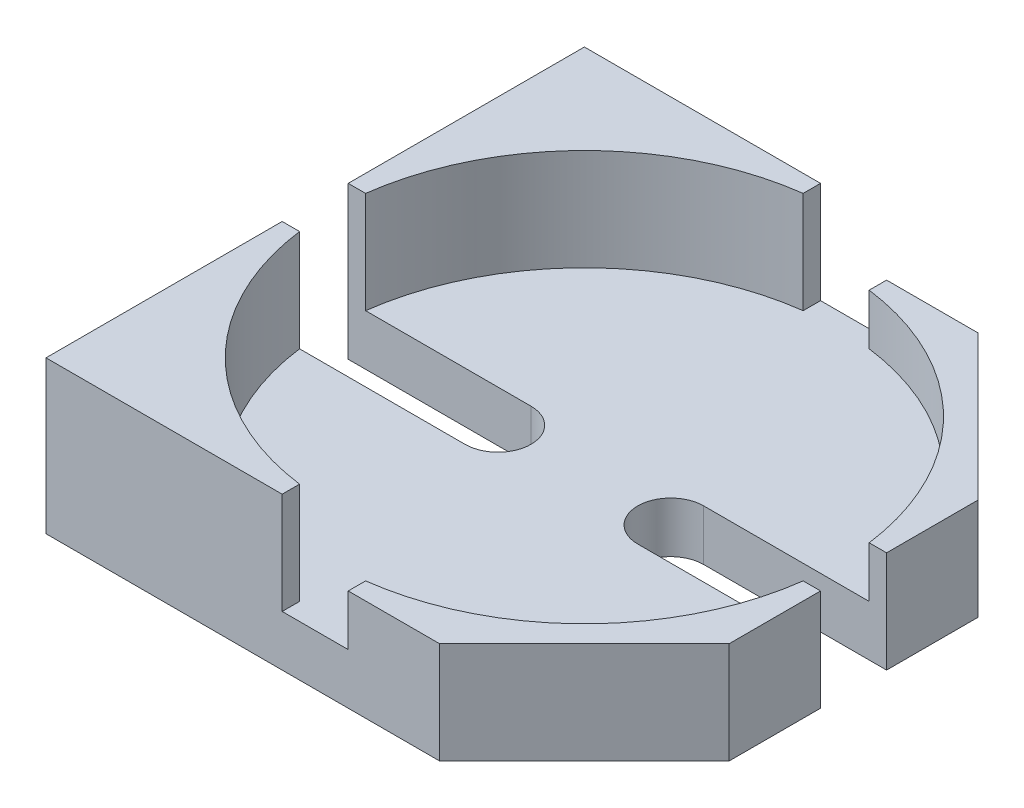
ISO-10303-21;
HEADER;
FILE_DESCRIPTION(('STEP AP214'),'2;1');
FILE_NAME('part.step','',(''),(''),'','','');
FILE_SCHEMA(('AUTOMOTIVE_DESIGN { 1 0 10303 214 1 1 1 1 }'));
ENDSEC;
DATA;
#1=APPLICATION_CONTEXT('core data for automotive mechanical design processes');
#2=APPLICATION_PROTOCOL_DEFINITION('international standard','automotive_design',2000,#1);
#3=PRODUCT_CONTEXT('',#1,'mechanical');
#4=PRODUCT('Part','Part','',(#3));
#5=PRODUCT_RELATED_PRODUCT_CATEGORY('part','',(#4));
#6=PRODUCT_DEFINITION_FORMATION('','',#4);
#7=PRODUCT_DEFINITION_CONTEXT('part definition',#1,'design');
#8=PRODUCT_DEFINITION('design','',#6,#7);
#9=PRODUCT_DEFINITION_SHAPE('','',#8);
#10=(LENGTH_UNIT() NAMED_UNIT(*) SI_UNIT(.MILLI.,.METRE.));
#11=(NAMED_UNIT(*) PLANE_ANGLE_UNIT() SI_UNIT($,.RADIAN.));
#12=(NAMED_UNIT(*) SI_UNIT($,.STERADIAN.) SOLID_ANGLE_UNIT());
#13=UNCERTAINTY_MEASURE_WITH_UNIT(LENGTH_MEASURE(1.E-05),#10,'distance_accuracy_value','');
#14=(GEOMETRIC_REPRESENTATION_CONTEXT(3) GLOBAL_UNCERTAINTY_ASSIGNED_CONTEXT((#13)) GLOBAL_UNIT_ASSIGNED_CONTEXT((#10,
#11,#12)) REPRESENTATION_CONTEXT('',''));
#15=CARTESIAN_POINT('',(0.,0.,0.));
#16=DIRECTION('',(0.,0.,1.));
#17=DIRECTION('',(1.,0.,0.));
#18=AXIS2_PLACEMENT_3D('',#15,#16,#17);
#19=CARTESIAN_POINT('',(0.,1.,0.));
#20=DIRECTION('',(0.,1.,0.));
#21=DIRECTION('',(1.,0.,0.));
#22=AXIS2_PLACEMENT_3D('',#19,#20,#21);
#23=PLANE('',#22);
#24=CARTESIAN_POINT('',(0.,1.,0.));
#25=DIRECTION('',(0.,1.,0.));
#26=DIRECTION('',(0.,0.,1.));
#27=AXIS2_PLACEMENT_3D('',#24,#25,#26);
#28=CIRCLE('',#27,2.5);
#29=CARTESIAN_POINT('',(0.325000000000007,1.,2.47878498462453));
#30=VERTEX_POINT('',#29);
#31=CARTESIAN_POINT('',(2.47878498462453,1.,0.325));
#32=VERTEX_POINT('',#31);
#33=EDGE_CURVE('E21',#30,#32,#28,.T.);
#34=ORIENTED_EDGE('',*,*,#33,.F.);
#35=DIRECTION('',(0.,0.,-1.));
#36=VECTOR('',#35,1.);
#37=CARTESIAN_POINT('',(0.325000000000007,1.,0.));
#38=LINE('',#37,#36);
#39=CARTESIAN_POINT('',(0.325000000000007,1.,2.65));
#40=VERTEX_POINT('',#39);
#41=EDGE_CURVE('E11',#40,#30,#38,.T.);
#42=ORIENTED_EDGE('',*,*,#41,.F.);
#43=DIRECTION('',(1.,0.,0.));
#44=VECTOR('',#43,1.);
#45=CARTESIAN_POINT('',(0.,1.,2.65));
#46=LINE('',#45,#44);
#47=CARTESIAN_POINT('',(1.22500000000002,1.,2.65));
#48=VERTEX_POINT('',#47);
#49=EDGE_CURVE('E328',#40,#48,#46,.T.);
#50=ORIENTED_EDGE('',*,*,#49,.T.);
#51=DIRECTION('',(0.707106781186544,0.,-0.707106781186552));
#52=VECTOR('',#51,1.);
#53=CARTESIAN_POINT('',(1.9375,1.,1.9375));
#54=LINE('',#53,#52);
#55=CARTESIAN_POINT('',(2.65,1.,1.225));
#56=VERTEX_POINT('',#55);
#57=EDGE_CURVE('E312',#48,#56,#54,.T.);
#58=ORIENTED_EDGE('',*,*,#57,.T.);
#59=DIRECTION('',(0.,0.,-1.));
#60=VECTOR('',#59,1.);
#61=CARTESIAN_POINT('',(2.65,1.,0.));
#62=LINE('',#61,#60);
#63=CARTESIAN_POINT('',(2.65,1.,0.325));
#64=VERTEX_POINT('',#63);
#65=EDGE_CURVE('E300',#56,#64,#62,.T.);
#66=ORIENTED_EDGE('',*,*,#65,.T.);
#67=DIRECTION('',(-1.,0.,0.));
#68=VECTOR('',#67,1.);
#69=CARTESIAN_POINT('',(0.,1.,0.325));
#70=LINE('',#69,#68);
#71=EDGE_CURVE('E284',#64,#32,#70,.T.);
#72=ORIENTED_EDGE('',*,*,#71,.T.);
#73=EDGE_LOOP('',(#34,#42,#50,#58,#66,#72));
#74=FACE_BOUND('',#73,.T.);
#75=ADVANCED_FACE('F17',(#74),#23,.T.);
#76=CARTESIAN_POINT('',(0.325000000000007,1.,0.));
#77=DIRECTION('',(-1.,0.,0.));
#78=DIRECTION('',(0.,0.,1.));
#79=AXIS2_PLACEMENT_3D('',#76,#77,#78);
#80=PLANE('',#79);
#81=DIRECTION('',(0.,0.,-1.));
#82=VECTOR('',#81,1.);
#83=CARTESIAN_POINT('',(0.325000000000007,0.5,0.));
#84=LINE('',#83,#82);
#85=CARTESIAN_POINT('',(0.325000000000007,0.5,2.65));
#86=VERTEX_POINT('',#85);
#87=CARTESIAN_POINT('',(0.325000000000007,0.5,2.47878498462453));
#88=VERTEX_POINT('',#87);
#89=EDGE_CURVE('E360',#86,#88,#84,.T.);
#90=ORIENTED_EDGE('',*,*,#89,.F.);
#91=DIRECTION('',(0.,-1.,0.));
#92=VECTOR('',#91,1.);
#93=CARTESIAN_POINT('',(0.325000000000007,1.,2.65));
#94=LINE('',#93,#92);
#95=EDGE_CURVE('E324',#40,#86,#94,.T.);
#96=ORIENTED_EDGE('',*,*,#95,.F.);
#97=ORIENTED_EDGE('',*,*,#41,.T.);
#98=DIRECTION('',(0.,-1.,0.));
#99=VECTOR('',#98,1.);
#100=CARTESIAN_POINT('',(0.325000000000007,1.,2.47878498462453));
#101=LINE('',#100,#99);
#102=EDGE_CURVE('E130',#30,#88,#101,.T.);
#103=ORIENTED_EDGE('',*,*,#102,.T.);
#104=EDGE_LOOP('',(#90,#96,#97,#103));
#105=FACE_BOUND('',#104,.T.);
#106=ADVANCED_FACE('F19',(#105),#80,.T.);
#107=CARTESIAN_POINT('',(0.,1.,0.));
#108=DIRECTION('',(0.,-1.,0.));
#109=DIRECTION('',(0.,0.,-1.));
#110=AXIS2_PLACEMENT_3D('',#107,#108,#109);
#111=CYLINDRICAL_SURFACE('',#110,2.5);
#112=CARTESIAN_POINT('',(0.,0.5,0.));
#113=DIRECTION('',(0.,1.,0.));
#114=DIRECTION('',(0.,0.,1.));
#115=AXIS2_PLACEMENT_3D('',#112,#113,#114);
#116=CIRCLE('',#115,2.5);
#117=CARTESIAN_POINT('',(2.47878498462453,0.5,0.325));
#118=VERTEX_POINT('',#117);
#119=EDGE_CURVE('E423',#88,#118,#116,.T.);
#120=ORIENTED_EDGE('',*,*,#119,.F.);
#121=ORIENTED_EDGE('',*,*,#102,.F.);
#122=ORIENTED_EDGE('',*,*,#33,.T.);
#123=DIRECTION('',(0.,-1.,0.));
#124=VECTOR('',#123,1.);
#125=CARTESIAN_POINT('',(2.47878498462453,1.,0.325));
#126=LINE('',#125,#124);
#127=EDGE_CURVE('E288',#32,#118,#126,.T.);
#128=ORIENTED_EDGE('',*,*,#127,.T.);
#129=EDGE_LOOP('',(#120,#121,#122,#128));
#130=FACE_BOUND('',#129,.T.);
#131=ADVANCED_FACE('F833',(#130),#111,.F.);
#132=CARTESIAN_POINT('',(0.,1.,0.));
#133=DIRECTION('',(0.,1.,0.));
#134=DIRECTION('',(1.,0.,0.));
#135=AXIS2_PLACEMENT_3D('',#132,#133,#134);
#136=PLANE('',#135);
#137=CARTESIAN_POINT('',(0.,1.,0.));
#138=DIRECTION('',(0.,1.,0.));
#139=DIRECTION('',(0.,0.,1.));
#140=AXIS2_PLACEMENT_3D('',#137,#138,#139);
#141=CIRCLE('',#140,2.5);
#142=CARTESIAN_POINT('',(2.47878498462453,1.,-0.325));
#143=VERTEX_POINT('',#142);
#144=CARTESIAN_POINT('',(0.325000000000015,1.,-2.47878498462452));
#145=VERTEX_POINT('',#144);
#146=EDGE_CURVE('E95',#143,#145,#141,.T.);
#147=ORIENTED_EDGE('',*,*,#146,.F.);
#148=DIRECTION('',(1.,0.,0.));
#149=VECTOR('',#148,1.);
#150=CARTESIAN_POINT('',(0.,1.,-0.325));
#151=LINE('',#150,#149);
#152=CARTESIAN_POINT('',(2.65,1.,-0.325));
#153=VERTEX_POINT('',#152);
#154=EDGE_CURVE('E270',#143,#153,#151,.T.);
#155=ORIENTED_EDGE('',*,*,#154,.T.);
#156=DIRECTION('',(0.,0.,-1.));
#157=VECTOR('',#156,1.);
#158=CARTESIAN_POINT('',(2.65,1.,0.));
#159=LINE('',#158,#157);
#160=CARTESIAN_POINT('',(2.65,1.,-1.225));
#161=VERTEX_POINT('',#160);
#162=EDGE_CURVE('E257',#153,#161,#159,.T.);
#163=ORIENTED_EDGE('',*,*,#162,.T.);
#164=DIRECTION('',(-0.707106781186549,0.,-0.707106781186546));
#165=VECTOR('',#164,1.);
#166=CARTESIAN_POINT('',(1.9375,1.,-1.9375));
#167=LINE('',#166,#165);
#168=CARTESIAN_POINT('',(1.225,1.,-2.65));
#169=VERTEX_POINT('',#168);
#170=EDGE_CURVE('E245',#161,#169,#167,.T.);
#171=ORIENTED_EDGE('',*,*,#170,.T.);
#172=DIRECTION('',(-1.,0.,0.));
#173=VECTOR('',#172,1.);
#174=CARTESIAN_POINT('',(0.,1.,-2.65));
#175=LINE('',#174,#173);
#176=CARTESIAN_POINT('',(0.325000000000015,1.,-2.65));
#177=VERTEX_POINT('',#176);
#178=EDGE_CURVE('E218',#169,#177,#175,.T.);
#179=ORIENTED_EDGE('',*,*,#178,.T.);
#180=DIRECTION('',(0.,0.,1.));
#181=VECTOR('',#180,1.);
#182=CARTESIAN_POINT('',(0.325000000000015,1.,0.));
#183=LINE('',#182,#181);
#184=EDGE_CURVE('E128',#177,#145,#183,.T.);
#185=ORIENTED_EDGE('',*,*,#184,.T.);
#186=EDGE_LOOP('',(#147,#155,#163,#171,#179,#185));
#187=FACE_BOUND('',#186,.T.);
#188=ADVANCED_FACE('F840',(#187),#136,.T.);
#189=CARTESIAN_POINT('',(0.325000000000015,1.,0.));
#190=DIRECTION('',(1.,0.,0.));
#191=DIRECTION('',(0.,1.,0.));
#192=AXIS2_PLACEMENT_3D('',#189,#190,#191);
#193=PLANE('',#192);
#194=DIRECTION('',(0.,0.,1.));
#195=VECTOR('',#194,1.);
#196=CARTESIAN_POINT('',(0.325000000000015,0.5,0.));
#197=LINE('',#196,#195);
#198=CARTESIAN_POINT('',(0.325000000000015,0.5,-2.65));
#199=VERTEX_POINT('',#198);
#200=CARTESIAN_POINT('',(0.325000000000015,0.5,-2.47878498462452));
#201=VERTEX_POINT('',#200);
#202=EDGE_CURVE('E394',#199,#201,#197,.T.);
#203=ORIENTED_EDGE('',*,*,#202,.T.);
#204=DIRECTION('',(0.,-1.,0.));
#205=VECTOR('',#204,1.);
#206=CARTESIAN_POINT('',(0.325000000000015,1.,-2.47878498462452));
#207=LINE('',#206,#205);
#208=EDGE_CURVE('E125',#145,#201,#207,.T.);
#209=ORIENTED_EDGE('',*,*,#208,.F.);
#210=ORIENTED_EDGE('',*,*,#184,.F.);
#211=DIRECTION('',(0.,-1.,0.));
#212=VECTOR('',#211,1.);
#213=CARTESIAN_POINT('',(0.325000000000015,1.,-2.65));
#214=LINE('',#213,#212);
#215=EDGE_CURVE('E223',#177,#199,#214,.T.);
#216=ORIENTED_EDGE('',*,*,#215,.T.);
#217=EDGE_LOOP('',(#203,#209,#210,#216));
#218=FACE_BOUND('',#217,.T.);
#219=ADVANCED_FACE('F848',(#218),#193,.F.);
#220=CARTESIAN_POINT('',(0.,1.,0.));
#221=DIRECTION('',(0.,-1.,0.));
#222=DIRECTION('',(0.,0.,-1.));
#223=AXIS2_PLACEMENT_3D('',#220,#221,#222);
#224=CYLINDRICAL_SURFACE('',#223,2.5);
#225=CARTESIAN_POINT('',(0.,0.5,0.));
#226=DIRECTION('',(0.,1.,0.));
#227=DIRECTION('',(0.,0.,1.));
#228=AXIS2_PLACEMENT_3D('',#225,#226,#227);
#229=CIRCLE('',#228,2.5);
#230=CARTESIAN_POINT('',(2.47878498462453,0.5,-0.325));
#231=VERTEX_POINT('',#230);
#232=EDGE_CURVE('E398',#231,#201,#229,.T.);
#233=ORIENTED_EDGE('',*,*,#232,.F.);
#234=DIRECTION('',(0.,-1.,0.));
#235=VECTOR('',#234,1.);
#236=CARTESIAN_POINT('',(2.47878498462453,1.,-0.325));
#237=LINE('',#236,#235);
#238=EDGE_CURVE('E266',#143,#231,#237,.T.);
#239=ORIENTED_EDGE('',*,*,#238,.F.);
#240=ORIENTED_EDGE('',*,*,#146,.T.);
#241=ORIENTED_EDGE('',*,*,#208,.T.);
#242=EDGE_LOOP('',(#233,#239,#240,#241));
#243=FACE_BOUND('',#242,.T.);
#244=ADVANCED_FACE('F856',(#243),#224,.F.);
#245=CARTESIAN_POINT('',(0.,1.5,0.));
#246=DIRECTION('',(0.,1.,0.));
#247=DIRECTION('',(1.,0.,0.));
#248=AXIS2_PLACEMENT_3D('',#245,#246,#247);
#249=PLANE('',#248);
#250=CARTESIAN_POINT('',(0.,1.5,0.));
#251=DIRECTION('',(0.,1.,0.));
#252=DIRECTION('',(0.,0.,1.));
#253=AXIS2_PLACEMENT_3D('',#250,#251,#252);
#254=CIRCLE('',#253,2.5);
#255=CARTESIAN_POINT('',(-2.47878498462453,1.5,0.325));
#256=VERTEX_POINT('',#255);
#257=CARTESIAN_POINT('',(-0.325000000000006,1.5,2.47878498462453));
#258=VERTEX_POINT('',#257);
#259=EDGE_CURVE('E85',#256,#258,#254,.T.);
#260=ORIENTED_EDGE('',*,*,#259,.F.);
#261=DIRECTION('',(-1.,0.,0.));
#262=VECTOR('',#261,1.);
#263=CARTESIAN_POINT('',(0.,1.5,0.325));
#264=LINE('',#263,#262);
#265=CARTESIAN_POINT('',(-2.65,1.5,0.325));
#266=VERTEX_POINT('',#265);
#267=EDGE_CURVE('E152',#256,#266,#264,.T.);
#268=ORIENTED_EDGE('',*,*,#267,.T.);
#269=DIRECTION('',(0.,0.,1.));
#270=VECTOR('',#269,1.);
#271=CARTESIAN_POINT('',(-2.65,1.5,0.));
#272=LINE('',#271,#270);
#273=CARTESIAN_POINT('',(-2.65,1.5,2.65));
#274=VERTEX_POINT('',#273);
#275=EDGE_CURVE('E341',#266,#274,#272,.T.);
#276=ORIENTED_EDGE('',*,*,#275,.T.);
#277=DIRECTION('',(1.,0.,0.));
#278=VECTOR('',#277,1.);
#279=CARTESIAN_POINT('',(0.,1.5,2.65));
#280=LINE('',#279,#278);
#281=CARTESIAN_POINT('',(-0.325000000000006,1.5,2.65));
#282=VERTEX_POINT('',#281);
#283=EDGE_CURVE('E90',#274,#282,#280,.T.);
#284=ORIENTED_EDGE('',*,*,#283,.T.);
#285=DIRECTION('',(0.,0.,-1.));
#286=VECTOR('',#285,1.);
#287=CARTESIAN_POINT('',(-0.325000000000007,1.5,0.));
#288=LINE('',#287,#286);
#289=EDGE_CURVE('E80',#282,#258,#288,.T.);
#290=ORIENTED_EDGE('',*,*,#289,.T.);
#291=EDGE_LOOP('',(#260,#268,#276,#284,#290));
#292=FACE_BOUND('',#291,.T.);
#293=ADVANCED_FACE('F82',(#292),#249,.T.);
#294=CARTESIAN_POINT('',(-0.325000000000007,1.5,0.));
#295=DIRECTION('',(-1.,0.,0.));
#296=DIRECTION('',(0.,1.,0.));
#297=AXIS2_PLACEMENT_3D('',#294,#295,#296);
#298=PLANE('',#297);
#299=DIRECTION('',(0.,0.,-1.));
#300=VECTOR('',#299,1.);
#301=CARTESIAN_POINT('',(-0.325000000000007,0.5,0.));
#302=LINE('',#301,#300);
#303=CARTESIAN_POINT('',(-0.325000000000006,0.5,2.65));
#304=VERTEX_POINT('',#303);
#305=CARTESIAN_POINT('',(-0.325000000000006,0.5,2.47878498462453));
#306=VERTEX_POINT('',#305);
#307=EDGE_CURVE('E103',#304,#306,#302,.T.);
#308=ORIENTED_EDGE('',*,*,#307,.T.);
#309=DIRECTION('',(0.,-1.,0.));
#310=VECTOR('',#309,1.);
#311=CARTESIAN_POINT('',(-0.325000000000006,1.5,2.47878498462453));
#312=LINE('',#311,#310);
#313=EDGE_CURVE('E96',#258,#306,#312,.T.);
#314=ORIENTED_EDGE('',*,*,#313,.F.);
#315=ORIENTED_EDGE('',*,*,#289,.F.);
#316=DIRECTION('',(0.,-1.,0.));
#317=VECTOR('',#316,1.);
#318=CARTESIAN_POINT('',(-0.325000000000006,1.5,2.65));
#319=LINE('',#318,#317);
#320=EDGE_CURVE('E321',#282,#304,#319,.T.);
#321=ORIENTED_EDGE('',*,*,#320,.T.);
#322=EDGE_LOOP('',(#308,#314,#315,#321));
#323=FACE_BOUND('',#322,.T.);
#324=ADVANCED_FACE('F100',(#323),#298,.F.);
#325=CARTESIAN_POINT('',(0.,1.5,0.));
#326=DIRECTION('',(0.,-1.,0.));
#327=DIRECTION('',(0.,0.,-1.));
#328=AXIS2_PLACEMENT_3D('',#325,#326,#327);
#329=CYLINDRICAL_SURFACE('',#328,2.5);
#330=CARTESIAN_POINT('',(0.,0.5,0.));
#331=DIRECTION('',(0.,1.,0.));
#332=DIRECTION('',(0.,0.,1.));
#333=AXIS2_PLACEMENT_3D('',#330,#331,#332);
#334=CIRCLE('',#333,2.5);
#335=CARTESIAN_POINT('',(-2.47878498462453,0.5,0.325));
#336=VERTEX_POINT('',#335);
#337=EDGE_CURVE('E361',#336,#306,#334,.T.);
#338=ORIENTED_EDGE('',*,*,#337,.F.);
#339=DIRECTION('',(0.,-1.,0.));
#340=VECTOR('',#339,1.);
#341=CARTESIAN_POINT('',(-2.47878498462453,1.5,0.325));
#342=LINE('',#341,#340);
#343=EDGE_CURVE('E111',#256,#336,#342,.T.);
#344=ORIENTED_EDGE('',*,*,#343,.F.);
#345=ORIENTED_EDGE('',*,*,#259,.T.);
#346=ORIENTED_EDGE('',*,*,#313,.T.);
#347=EDGE_LOOP('',(#338,#344,#345,#346));
#348=FACE_BOUND('',#347,.T.);
#349=ADVANCED_FACE('F109',(#348),#329,.F.);
#350=CARTESIAN_POINT('',(0.,1.5,0.));
#351=DIRECTION('',(0.,1.,0.));
#352=DIRECTION('',(1.,0.,0.));
#353=AXIS2_PLACEMENT_3D('',#350,#351,#352);
#354=PLANE('',#353);
#355=CARTESIAN_POINT('',(0.,1.5,0.));
#356=DIRECTION('',(0.,1.,0.));
#357=DIRECTION('',(0.,0.,1.));
#358=AXIS2_PLACEMENT_3D('',#355,#356,#357);
#359=CIRCLE('',#358,2.5);
#360=CARTESIAN_POINT('',(-0.325000000000009,1.5,-2.47878498462453));
#361=VERTEX_POINT('',#360);
#362=CARTESIAN_POINT('',(-2.47878498462453,1.5,-0.325));
#363=VERTEX_POINT('',#362);
#364=EDGE_CURVE('E120',#361,#363,#359,.T.);
#365=ORIENTED_EDGE('',*,*,#364,.F.);
#366=DIRECTION('',(0.,0.,1.));
#367=VECTOR('',#366,1.);
#368=CARTESIAN_POINT('',(-0.325000000000008,1.5,0.));
#369=LINE('',#368,#367);
#370=CARTESIAN_POINT('',(-0.32500000000001,1.5,-2.65));
#371=VERTEX_POINT('',#370);
#372=EDGE_CURVE('E114',#371,#361,#369,.T.);
#373=ORIENTED_EDGE('',*,*,#372,.F.);
#374=DIRECTION('',(-1.,0.,0.));
#375=VECTOR('',#374,1.);
#376=CARTESIAN_POINT('',(0.,1.5,-2.65));
#377=LINE('',#376,#375);
#378=CARTESIAN_POINT('',(-2.65,1.5,-2.65));
#379=VERTEX_POINT('',#378);
#380=EDGE_CURVE('E228',#371,#379,#377,.T.);
#381=ORIENTED_EDGE('',*,*,#380,.T.);
#382=DIRECTION('',(0.,0.,1.));
#383=VECTOR('',#382,1.);
#384=CARTESIAN_POINT('',(-2.65,1.5,0.));
#385=LINE('',#384,#383);
#386=CARTESIAN_POINT('',(-2.65,1.5,-0.325));
#387=VERTEX_POINT('',#386);
#388=EDGE_CURVE('E185',#379,#387,#385,.T.);
#389=ORIENTED_EDGE('',*,*,#388,.T.);
#390=DIRECTION('',(1.,0.,0.));
#391=VECTOR('',#390,1.);
#392=CARTESIAN_POINT('',(0.,1.5,-0.325));
#393=LINE('',#392,#391);
#394=EDGE_CURVE('E182',#387,#363,#393,.T.);
#395=ORIENTED_EDGE('',*,*,#394,.T.);
#396=EDGE_LOOP('',(#365,#373,#381,#389,#395));
#397=FACE_BOUND('',#396,.T.);
#398=ADVANCED_FACE('F183',(#397),#354,.T.);
#399=CARTESIAN_POINT('',(-0.325000000000008,1.5,0.));
#400=DIRECTION('',(1.,0.,0.));
#401=DIRECTION('',(0.,0.,-1.));
#402=AXIS2_PLACEMENT_3D('',#399,#400,#401);
#403=PLANE('',#402);
#404=DIRECTION('',(0.,0.,1.));
#405=VECTOR('',#404,1.);
#406=CARTESIAN_POINT('',(-0.325000000000008,0.5,0.));
#407=LINE('',#406,#405);
#408=CARTESIAN_POINT('',(-0.32500000000001,0.5,-2.65));
#409=VERTEX_POINT('',#408);
#410=CARTESIAN_POINT('',(-0.325000000000009,0.5,-2.47878498462453));
#411=VERTEX_POINT('',#410);
#412=EDGE_CURVE('E381',#409,#411,#407,.T.);
#413=ORIENTED_EDGE('',*,*,#412,.F.);
#414=DIRECTION('',(0.,-1.,0.));
#415=VECTOR('',#414,1.);
#416=CARTESIAN_POINT('',(-0.32500000000001,1.5,-2.65));
#417=LINE('',#416,#415);
#418=EDGE_CURVE('E227',#371,#409,#417,.T.);
#419=ORIENTED_EDGE('',*,*,#418,.F.);
#420=ORIENTED_EDGE('',*,*,#372,.T.);
#421=DIRECTION('',(0.,-1.,0.));
#422=VECTOR('',#421,1.);
#423=CARTESIAN_POINT('',(-0.325000000000009,1.5,-2.47878498462453));
#424=LINE('',#423,#422);
#425=EDGE_CURVE('E157',#361,#411,#424,.T.);
#426=ORIENTED_EDGE('',*,*,#425,.T.);
#427=EDGE_LOOP('',(#413,#419,#420,#426));
#428=FACE_BOUND('',#427,.T.);
#429=ADVANCED_FACE('F894',(#428),#403,.T.);
#430=CARTESIAN_POINT('',(0.,1.5,0.));
#431=DIRECTION('',(0.,-1.,0.));
#432=DIRECTION('',(0.,0.,-1.));
#433=AXIS2_PLACEMENT_3D('',#430,#431,#432);
#434=CYLINDRICAL_SURFACE('',#433,2.5);
#435=CARTESIAN_POINT('',(0.,0.5,0.));
#436=DIRECTION('',(0.,1.,0.));
#437=DIRECTION('',(0.,0.,1.));
#438=AXIS2_PLACEMENT_3D('',#435,#436,#437);
#439=CIRCLE('',#438,2.5);
#440=CARTESIAN_POINT('',(-2.47878498462453,0.5,-0.325));
#441=VERTEX_POINT('',#440);
#442=EDGE_CURVE('E377',#411,#441,#439,.T.);
#443=ORIENTED_EDGE('',*,*,#442,.F.);
#444=ORIENTED_EDGE('',*,*,#425,.F.);
#445=ORIENTED_EDGE('',*,*,#364,.T.);
#446=DIRECTION('',(0.,-1.,0.));
#447=VECTOR('',#446,1.);
#448=CARTESIAN_POINT('',(-2.47878498462453,1.5,-0.325));
#449=LINE('',#448,#447);
#450=EDGE_CURVE('E177',#363,#441,#449,.T.);
#451=ORIENTED_EDGE('',*,*,#450,.T.);
#452=EDGE_LOOP('',(#443,#444,#445,#451));
#453=FACE_BOUND('',#452,.T.);
#454=ADVANCED_FACE('F174',(#453),#434,.F.);
#455=CARTESIAN_POINT('',(0.85,0.,0.));
#456=DIRECTION('',(0.,1.,0.));
#457=DIRECTION('',(1.,0.,0.));
#458=AXIS2_PLACEMENT_3D('',#455,#456,#457);
#459=PLANE('',#458);
#460=DIRECTION('',(0.,0.,1.));
#461=VECTOR('',#460,1.);
#462=CARTESIAN_POINT('',(-2.65,0.,0.325));
#463=LINE('',#462,#461);
#464=CARTESIAN_POINT('',(-2.65,0.,0.325));
#465=VERTEX_POINT('',#464);
#466=CARTESIAN_POINT('',(-2.65,0.,2.65));
#467=VERTEX_POINT('',#466);
#468=EDGE_CURVE('E356',#465,#467,#463,.T.);
#469=ORIENTED_EDGE('',*,*,#468,.F.);
#470=DIRECTION('',(-1.,0.,0.));
#471=VECTOR('',#470,1.);
#472=CARTESIAN_POINT('',(-0.85,0.,0.325));
#473=LINE('',#472,#471);
#474=CARTESIAN_POINT('',(-0.85,0.,0.325));
#475=VERTEX_POINT('',#474);
#476=EDGE_CURVE('E155',#475,#465,#473,.T.);
#477=ORIENTED_EDGE('',*,*,#476,.F.);
#478=CARTESIAN_POINT('',(-0.85,0.,0.));
#479=DIRECTION('',(0.,-1.,0.));
#480=DIRECTION('',(0.,0.,1.));
#481=AXIS2_PLACEMENT_3D('',#478,#479,#480);
#482=CIRCLE('',#481,0.325);
#483=CARTESIAN_POINT('',(-0.85,0.,-0.325));
#484=VERTEX_POINT('',#483);
#485=EDGE_CURVE('E150',#484,#475,#482,.T.);
#486=ORIENTED_EDGE('',*,*,#485,.F.);
#487=DIRECTION('',(1.,0.,0.));
#488=VECTOR('',#487,1.);
#489=CARTESIAN_POINT('',(-0.85,0.,-0.325));
#490=LINE('',#489,#488);
#491=CARTESIAN_POINT('',(-2.65,0.,-0.325));
#492=VERTEX_POINT('',#491);
#493=EDGE_CURVE('E203',#492,#484,#490,.T.);
#494=ORIENTED_EDGE('',*,*,#493,.F.);
#495=DIRECTION('',(0.,0.,1.));
#496=VECTOR('',#495,1.);
#497=CARTESIAN_POINT('',(-2.65,0.,-2.65));
#498=LINE('',#497,#496);
#499=CARTESIAN_POINT('',(-2.65,0.,-2.65));
#500=VERTEX_POINT('',#499);
#501=EDGE_CURVE('E211',#500,#492,#498,.T.);
#502=ORIENTED_EDGE('',*,*,#501,.F.);
#503=DIRECTION('',(-1.,0.,0.));
#504=VECTOR('',#503,1.);
#505=CARTESIAN_POINT('',(1.225,0.,-2.65));
#506=LINE('',#505,#504);
#507=CARTESIAN_POINT('',(1.225,0.,-2.65));
#508=VERTEX_POINT('',#507);
#509=EDGE_CURVE('E235',#508,#500,#506,.T.);
#510=ORIENTED_EDGE('',*,*,#509,.F.);
#511=DIRECTION('',(-0.707106781186549,0.,-0.707106781186546));
#512=VECTOR('',#511,1.);
#513=CARTESIAN_POINT('',(1.225,0.,-2.65));
#514=LINE('',#513,#512);
#515=CARTESIAN_POINT('',(2.65,0.,-1.225));
#516=VERTEX_POINT('',#515);
#517=EDGE_CURVE('E253',#516,#508,#514,.T.);
#518=ORIENTED_EDGE('',*,*,#517,.F.);
#519=DIRECTION('',(0.,0.,-1.));
#520=VECTOR('',#519,1.);
#521=CARTESIAN_POINT('',(2.65,0.,-1.225));
#522=LINE('',#521,#520);
#523=CARTESIAN_POINT('',(2.65,0.,-0.325));
#524=VERTEX_POINT('',#523);
#525=EDGE_CURVE('E262',#524,#516,#522,.T.);
#526=ORIENTED_EDGE('',*,*,#525,.F.);
#527=DIRECTION('',(1.,0.,0.));
#528=VECTOR('',#527,1.);
#529=CARTESIAN_POINT('',(0.85,0.,-0.325));
#530=LINE('',#529,#528);
#531=CARTESIAN_POINT('',(0.85,0.,-0.325));
#532=VERTEX_POINT('',#531);
#533=EDGE_CURVE('E279',#532,#524,#530,.T.);
#534=ORIENTED_EDGE('',*,*,#533,.F.);
#535=CARTESIAN_POINT('',(0.85,0.,0.));
#536=DIRECTION('',(0.,-1.,0.));
#537=DIRECTION('',(0.,0.,1.));
#538=AXIS2_PLACEMENT_3D('',#535,#536,#537);
#539=CIRCLE('',#538,0.325);
#540=CARTESIAN_POINT('',(0.85,0.,0.325));
#541=VERTEX_POINT('',#540);
#542=EDGE_CURVE('E280',#541,#532,#539,.T.);
#543=ORIENTED_EDGE('',*,*,#542,.F.);
#544=DIRECTION('',(-1.,0.,0.));
#545=VECTOR('',#544,1.);
#546=CARTESIAN_POINT('',(0.85,0.,0.325));
#547=LINE('',#546,#545);
#548=CARTESIAN_POINT('',(2.65,0.,0.325));
#549=VERTEX_POINT('',#548);
#550=EDGE_CURVE('E296',#549,#541,#547,.T.);
#551=ORIENTED_EDGE('',*,*,#550,.F.);
#552=DIRECTION('',(0.,0.,-1.));
#553=VECTOR('',#552,1.);
#554=CARTESIAN_POINT('',(2.65,0.,0.325));
#555=LINE('',#554,#553);
#556=CARTESIAN_POINT('',(2.65,0.,1.225));
#557=VERTEX_POINT('',#556);
#558=EDGE_CURVE('E308',#557,#549,#555,.T.);
#559=ORIENTED_EDGE('',*,*,#558,.F.);
#560=DIRECTION('',(0.707106781186544,0.,-0.707106781186552));
#561=VECTOR('',#560,1.);
#562=CARTESIAN_POINT('',(1.22500000000002,0.,2.65));
#563=LINE('',#562,#561);
#564=CARTESIAN_POINT('',(1.22500000000002,0.,2.65));
#565=VERTEX_POINT('',#564);
#566=EDGE_CURVE('E317',#565,#557,#563,.T.);
#567=ORIENTED_EDGE('',*,*,#566,.F.);
#568=DIRECTION('',(1.,0.,0.));
#569=VECTOR('',#568,1.);
#570=CARTESIAN_POINT('',(1.22500000000002,0.,2.65));
#571=LINE('',#570,#569);
#572=EDGE_CURVE('E336',#467,#565,#571,.T.);
#573=ORIENTED_EDGE('',*,*,#572,.F.);
#574=EDGE_LOOP('',(#469,#477,#486,#494,#502,#510,#518,#526,#534,#543,#551,#559,#567,#573));
#575=FACE_BOUND('',#574,.T.);
#576=ADVANCED_FACE('F447',(#575),#459,.F.);
#577=CARTESIAN_POINT('',(-0.85,0.5,0.325));
#578=DIRECTION('',(0.,0.,1.));
#579=DIRECTION('',(1.,0.,0.));
#580=AXIS2_PLACEMENT_3D('',#577,#578,#579);
#581=PLANE('',#580);
#582=ORIENTED_EDGE('',*,*,#476,.T.);
#583=DIRECTION('',(0.,-1.,0.));
#584=VECTOR('',#583,1.);
#585=CARTESIAN_POINT('',(-2.65,0.5,0.325));
#586=LINE('',#585,#584);
#587=EDGE_CURVE('E340',#266,#465,#586,.T.);
#588=ORIENTED_EDGE('',*,*,#587,.F.);
#589=ORIENTED_EDGE('',*,*,#267,.F.);
#590=ORIENTED_EDGE('',*,*,#343,.T.);
#591=DIRECTION('',(-1.,0.,0.));
#592=VECTOR('',#591,1.);
#593=CARTESIAN_POINT('',(-0.85,0.5,0.325));
#594=LINE('',#593,#592);
#595=CARTESIAN_POINT('',(-0.85,0.5,0.325));
#596=VERTEX_POINT('',#595);
#597=EDGE_CURVE('E364',#596,#336,#594,.T.);
#598=ORIENTED_EDGE('',*,*,#597,.F.);
#599=DIRECTION('',(0.,-1.,0.));
#600=VECTOR('',#599,1.);
#601=CARTESIAN_POINT('',(-0.85,0.5,0.325));
#602=LINE('',#601,#600);
#603=EDGE_CURVE('E219',#596,#475,#602,.T.);
#604=ORIENTED_EDGE('',*,*,#603,.T.);
#605=EDGE_LOOP('',(#582,#588,#589,#590,#598,#604));
#606=FACE_BOUND('',#605,.T.);
#607=ADVANCED_FACE('F913',(#606),#581,.F.);
#608=CARTESIAN_POINT('',(-0.85,0.5,0.));
#609=DIRECTION('',(0.,-1.,0.));
#610=DIRECTION('',(0.,0.,-1.));
#611=AXIS2_PLACEMENT_3D('',#608,#609,#610);
#612=CYLINDRICAL_SURFACE('',#611,0.325);
#613=ORIENTED_EDGE('',*,*,#485,.T.);
#614=ORIENTED_EDGE('',*,*,#603,.F.);
#615=CARTESIAN_POINT('',(-0.85,0.5,0.));
#616=DIRECTION('',(0.,-1.,0.));
#617=DIRECTION('',(0.,0.,1.));
#618=AXIS2_PLACEMENT_3D('',#615,#616,#617);
#619=CIRCLE('',#618,0.325);
#620=CARTESIAN_POINT('',(-0.85,0.5,-0.325));
#621=VERTEX_POINT('',#620);
#622=EDGE_CURVE('E372',#621,#596,#619,.T.);
#623=ORIENTED_EDGE('',*,*,#622,.F.);
#624=DIRECTION('',(0.,-1.,0.));
#625=VECTOR('',#624,1.);
#626=CARTESIAN_POINT('',(-0.85,0.5,-0.325));
#627=LINE('',#626,#625);
#628=EDGE_CURVE('E198',#621,#484,#627,.T.);
#629=ORIENTED_EDGE('',*,*,#628,.T.);
#630=EDGE_LOOP('',(#613,#614,#623,#629));
#631=FACE_BOUND('',#630,.T.);
#632=ADVANCED_FACE('F917',(#631),#612,.F.);
#633=CARTESIAN_POINT('',(-0.85,0.5,-0.325));
#634=DIRECTION('',(0.,0.,-1.));
#635=DIRECTION('',(-1.,0.,0.));
#636=AXIS2_PLACEMENT_3D('',#633,#634,#635);
#637=PLANE('',#636);
#638=ORIENTED_EDGE('',*,*,#493,.T.);
#639=ORIENTED_EDGE('',*,*,#628,.F.);
#640=DIRECTION('',(1.,0.,0.));
#641=VECTOR('',#640,1.);
#642=CARTESIAN_POINT('',(-0.85,0.5,-0.325));
#643=LINE('',#642,#641);
#644=EDGE_CURVE('E195',#441,#621,#643,.T.);
#645=ORIENTED_EDGE('',*,*,#644,.F.);
#646=ORIENTED_EDGE('',*,*,#450,.F.);
#647=ORIENTED_EDGE('',*,*,#394,.F.);
#648=DIRECTION('',(0.,-1.,0.));
#649=VECTOR('',#648,1.);
#650=CARTESIAN_POINT('',(-2.65,0.5,-0.325));
#651=LINE('',#650,#649);
#652=EDGE_CURVE('E208',#387,#492,#651,.T.);
#653=ORIENTED_EDGE('',*,*,#652,.T.);
#654=EDGE_LOOP('',(#638,#639,#645,#646,#647,#653));
#655=FACE_BOUND('',#654,.T.);
#656=ADVANCED_FACE('F192',(#655),#637,.F.);
#657=CARTESIAN_POINT('',(-2.65,0.5,-2.65));
#658=DIRECTION('',(1.,0.,0.));
#659=DIRECTION('',(0.,0.,-1.));
#660=AXIS2_PLACEMENT_3D('',#657,#658,#659);
#661=PLANE('',#660);
#662=ORIENTED_EDGE('',*,*,#501,.T.);
#663=ORIENTED_EDGE('',*,*,#652,.F.);
#664=ORIENTED_EDGE('',*,*,#388,.F.);
#665=DIRECTION('',(0.,-1.,0.));
#666=VECTOR('',#665,1.);
#667=CARTESIAN_POINT('',(-2.65,0.5,-2.65));
#668=LINE('',#667,#666);
#669=EDGE_CURVE('E230',#379,#500,#668,.T.);
#670=ORIENTED_EDGE('',*,*,#669,.T.);
#671=EDGE_LOOP('',(#662,#663,#664,#670));
#672=FACE_BOUND('',#671,.T.);
#673=ADVANCED_FACE('F537',(#672),#661,.F.);
#674=CARTESIAN_POINT('',(1.225,0.5,-2.65));
#675=DIRECTION('',(0.,0.,1.));
#676=DIRECTION('',(1.,0.,0.));
#677=AXIS2_PLACEMENT_3D('',#674,#675,#676);
#678=PLANE('',#677);
#679=ORIENTED_EDGE('',*,*,#509,.T.);
#680=ORIENTED_EDGE('',*,*,#669,.F.);
#681=ORIENTED_EDGE('',*,*,#380,.F.);
#682=ORIENTED_EDGE('',*,*,#418,.T.);
#683=DIRECTION('',(-1.,0.,0.));
#684=VECTOR('',#683,1.);
#685=CARTESIAN_POINT('',(1.225,0.5,-2.65));
#686=LINE('',#685,#684);
#687=EDGE_CURVE('E388',#199,#409,#686,.T.);
#688=ORIENTED_EDGE('',*,*,#687,.F.);
#689=ORIENTED_EDGE('',*,*,#215,.F.);
#690=ORIENTED_EDGE('',*,*,#178,.F.);
#691=DIRECTION('',(0.,-1.,0.));
#692=VECTOR('',#691,1.);
#693=CARTESIAN_POINT('',(1.225,0.5,-2.65));
#694=LINE('',#693,#692);
#695=EDGE_CURVE('E249',#169,#508,#694,.T.);
#696=ORIENTED_EDGE('',*,*,#695,.T.);
#697=EDGE_LOOP('',(#679,#680,#681,#682,#688,#689,#690,#696));
#698=FACE_BOUND('',#697,.T.);
#699=ADVANCED_FACE('F539',(#698),#678,.F.);
#700=CARTESIAN_POINT('',(1.225,0.5,-2.65));
#701=DIRECTION('',(-0.707106781186546,0.,0.707106781186549));
#702=DIRECTION('',(0.,1.,0.));
#703=AXIS2_PLACEMENT_3D('',#700,#701,#702);
#704=PLANE('',#703);
#705=ORIENTED_EDGE('',*,*,#517,.T.);
#706=ORIENTED_EDGE('',*,*,#695,.F.);
#707=ORIENTED_EDGE('',*,*,#170,.F.);
#708=DIRECTION('',(0.,-1.,0.));
#709=VECTOR('',#708,1.);
#710=CARTESIAN_POINT('',(2.65,0.5,-1.225));
#711=LINE('',#710,#709);
#712=EDGE_CURVE('E261',#161,#516,#711,.T.);
#713=ORIENTED_EDGE('',*,*,#712,.T.);
#714=EDGE_LOOP('',(#705,#706,#707,#713));
#715=FACE_BOUND('',#714,.T.);
#716=ADVANCED_FACE('F542',(#715),#704,.F.);
#717=CARTESIAN_POINT('',(2.65,0.5,-1.225));
#718=DIRECTION('',(-1.,0.,0.));
#719=DIRECTION('',(0.,0.,1.));
#720=AXIS2_PLACEMENT_3D('',#717,#718,#719);
#721=PLANE('',#720);
#722=ORIENTED_EDGE('',*,*,#525,.T.);
#723=ORIENTED_EDGE('',*,*,#712,.F.);
#724=ORIENTED_EDGE('',*,*,#162,.F.);
#725=DIRECTION('',(0.,-1.,0.));
#726=VECTOR('',#725,1.);
#727=CARTESIAN_POINT('',(2.65,0.5,-0.325));
#728=LINE('',#727,#726);
#729=EDGE_CURVE('E274',#153,#524,#728,.T.);
#730=ORIENTED_EDGE('',*,*,#729,.T.);
#731=EDGE_LOOP('',(#722,#723,#724,#730));
#732=FACE_BOUND('',#731,.T.);
#733=ADVANCED_FACE('F549',(#732),#721,.F.);
#734=CARTESIAN_POINT('',(0.85,0.5,-0.325));
#735=DIRECTION('',(0.,0.,-1.));
#736=DIRECTION('',(0.,-1.,0.));
#737=AXIS2_PLACEMENT_3D('',#734,#735,#736);
#738=PLANE('',#737);
#739=ORIENTED_EDGE('',*,*,#533,.T.);
#740=ORIENTED_EDGE('',*,*,#729,.F.);
#741=ORIENTED_EDGE('',*,*,#154,.F.);
#742=ORIENTED_EDGE('',*,*,#238,.T.);
#743=DIRECTION('',(1.,0.,0.));
#744=VECTOR('',#743,1.);
#745=CARTESIAN_POINT('',(0.85,0.5,-0.325));
#746=LINE('',#745,#744);
#747=CARTESIAN_POINT('',(0.85,0.5,-0.325));
#748=VERTEX_POINT('',#747);
#749=EDGE_CURVE('E407',#748,#231,#746,.T.);
#750=ORIENTED_EDGE('',*,*,#749,.F.);
#751=DIRECTION('',(0.,-1.,0.));
#752=VECTOR('',#751,1.);
#753=CARTESIAN_POINT('',(0.85,0.5,-0.325));
#754=LINE('',#753,#752);
#755=EDGE_CURVE('E275',#748,#532,#754,.T.);
#756=ORIENTED_EDGE('',*,*,#755,.T.);
#757=EDGE_LOOP('',(#739,#740,#741,#742,#750,#756));
#758=FACE_BOUND('',#757,.T.);
#759=ADVANCED_FACE('F552',(#758),#738,.F.);
#760=CARTESIAN_POINT('',(0.85,0.5,0.));
#761=DIRECTION('',(0.,-1.,0.));
#762=DIRECTION('',(0.,0.,-1.));
#763=AXIS2_PLACEMENT_3D('',#760,#761,#762);
#764=CYLINDRICAL_SURFACE('',#763,0.325);
#765=ORIENTED_EDGE('',*,*,#542,.T.);
#766=ORIENTED_EDGE('',*,*,#755,.F.);
#767=CARTESIAN_POINT('',(0.85,0.5,0.));
#768=DIRECTION('',(0.,-1.,0.));
#769=DIRECTION('',(0.,0.,1.));
#770=AXIS2_PLACEMENT_3D('',#767,#768,#769);
#771=CIRCLE('',#770,0.325);
#772=CARTESIAN_POINT('',(0.85,0.5,0.325));
#773=VERTEX_POINT('',#772);
#774=EDGE_CURVE('E413',#773,#748,#771,.T.);
#775=ORIENTED_EDGE('',*,*,#774,.F.);
#776=DIRECTION('',(0.,-1.,0.));
#777=VECTOR('',#776,1.);
#778=CARTESIAN_POINT('',(0.85,0.5,0.325));
#779=LINE('',#778,#777);
#780=EDGE_CURVE('E292',#773,#541,#779,.T.);
#781=ORIENTED_EDGE('',*,*,#780,.T.);
#782=EDGE_LOOP('',(#765,#766,#775,#781));
#783=FACE_BOUND('',#782,.T.);
#784=ADVANCED_FACE('F558',(#783),#764,.F.);
#785=CARTESIAN_POINT('',(0.85,0.5,0.325));
#786=DIRECTION('',(0.,0.,1.));
#787=DIRECTION('',(1.,0.,0.));
#788=AXIS2_PLACEMENT_3D('',#785,#786,#787);
#789=PLANE('',#788);
#790=ORIENTED_EDGE('',*,*,#550,.T.);
#791=ORIENTED_EDGE('',*,*,#780,.F.);
#792=DIRECTION('',(-1.,0.,0.));
#793=VECTOR('',#792,1.);
#794=CARTESIAN_POINT('',(0.85,0.5,0.325));
#795=LINE('',#794,#793);
#796=EDGE_CURVE('E416',#118,#773,#795,.T.);
#797=ORIENTED_EDGE('',*,*,#796,.F.);
#798=ORIENTED_EDGE('',*,*,#127,.F.);
#799=ORIENTED_EDGE('',*,*,#71,.F.);
#800=DIRECTION('',(0.,-1.,0.));
#801=VECTOR('',#800,1.);
#802=CARTESIAN_POINT('',(2.65,0.5,0.325));
#803=LINE('',#802,#801);
#804=EDGE_CURVE('E304',#64,#549,#803,.T.);
#805=ORIENTED_EDGE('',*,*,#804,.T.);
#806=EDGE_LOOP('',(#790,#791,#797,#798,#799,#805));
#807=FACE_BOUND('',#806,.T.);
#808=ADVANCED_FACE('F563',(#807),#789,.F.);
#809=CARTESIAN_POINT('',(2.65,0.5,0.325));
#810=DIRECTION('',(-1.,0.,0.));
#811=DIRECTION('',(0.,1.,0.));
#812=AXIS2_PLACEMENT_3D('',#809,#810,#811);
#813=PLANE('',#812);
#814=ORIENTED_EDGE('',*,*,#558,.T.);
#815=ORIENTED_EDGE('',*,*,#804,.F.);
#816=ORIENTED_EDGE('',*,*,#65,.F.);
#817=DIRECTION('',(0.,-1.,0.));
#818=VECTOR('',#817,1.);
#819=CARTESIAN_POINT('',(2.65,0.5,1.225));
#820=LINE('',#819,#818);
#821=EDGE_CURVE('E316',#56,#557,#820,.T.);
#822=ORIENTED_EDGE('',*,*,#821,.T.);
#823=EDGE_LOOP('',(#814,#815,#816,#822));
#824=FACE_BOUND('',#823,.T.);
#825=ADVANCED_FACE('F566',(#824),#813,.F.);
#826=CARTESIAN_POINT('',(1.22500000000002,0.5,2.65));
#827=DIRECTION('',(-0.707106781186552,0.,-0.707106781186544));
#828=DIRECTION('',(-0.707106781186544,0.,0.707106781186552));
#829=AXIS2_PLACEMENT_3D('',#826,#827,#828);
#830=PLANE('',#829);
#831=ORIENTED_EDGE('',*,*,#566,.T.);
#832=ORIENTED_EDGE('',*,*,#821,.F.);
#833=ORIENTED_EDGE('',*,*,#57,.F.);
#834=DIRECTION('',(0.,-1.,0.));
#835=VECTOR('',#834,1.);
#836=CARTESIAN_POINT('',(1.22500000000002,0.5,2.65));
#837=LINE('',#836,#835);
#838=EDGE_CURVE('E332',#48,#565,#837,.T.);
#839=ORIENTED_EDGE('',*,*,#838,.T.);
#840=EDGE_LOOP('',(#831,#832,#833,#839));
#841=FACE_BOUND('',#840,.T.);
#842=ADVANCED_FACE('F569',(#841),#830,.F.);
#843=CARTESIAN_POINT('',(1.22500000000002,0.5,2.65));
#844=DIRECTION('',(0.,0.,-1.));
#845=DIRECTION('',(0.,-1.,0.));
#846=AXIS2_PLACEMENT_3D('',#843,#844,#845);
#847=PLANE('',#846);
#848=ORIENTED_EDGE('',*,*,#572,.T.);
#849=ORIENTED_EDGE('',*,*,#838,.F.);
#850=ORIENTED_EDGE('',*,*,#49,.F.);
#851=ORIENTED_EDGE('',*,*,#95,.T.);
#852=DIRECTION('',(1.,0.,0.));
#853=VECTOR('',#852,1.);
#854=CARTESIAN_POINT('',(1.22500000000002,0.5,2.65));
#855=LINE('',#854,#853);
#856=EDGE_CURVE('E365',#304,#86,#855,.T.);
#857=ORIENTED_EDGE('',*,*,#856,.F.);
#858=ORIENTED_EDGE('',*,*,#320,.F.);
#859=ORIENTED_EDGE('',*,*,#283,.F.);
#860=DIRECTION('',(0.,-1.,0.));
#861=VECTOR('',#860,1.);
#862=CARTESIAN_POINT('',(-2.65,0.5,2.65));
#863=LINE('',#862,#861);
#864=EDGE_CURVE('E344',#274,#467,#863,.T.);
#865=ORIENTED_EDGE('',*,*,#864,.T.);
#866=EDGE_LOOP('',(#848,#849,#850,#851,#857,#858,#859,#865));
#867=FACE_BOUND('',#866,.T.);
#868=ADVANCED_FACE('F456',(#867),#847,.F.);
#869=CARTESIAN_POINT('',(-2.65,0.5,0.325));
#870=DIRECTION('',(1.,0.,0.));
#871=DIRECTION('',(0.,0.,1.));
#872=AXIS2_PLACEMENT_3D('',#869,#870,#871);
#873=PLANE('',#872);
#874=ORIENTED_EDGE('',*,*,#468,.T.);
#875=ORIENTED_EDGE('',*,*,#864,.F.);
#876=ORIENTED_EDGE('',*,*,#275,.F.);
#877=ORIENTED_EDGE('',*,*,#587,.T.);
#878=EDGE_LOOP('',(#874,#875,#876,#877));
#879=FACE_BOUND('',#878,.T.);
#880=ADVANCED_FACE('F436',(#879),#873,.F.);
#881=CARTESIAN_POINT('',(0.85,0.5,0.));
#882=DIRECTION('',(0.,1.,0.));
#883=DIRECTION('',(1.,0.,0.));
#884=AXIS2_PLACEMENT_3D('',#881,#882,#883);
#885=PLANE('',#884);
#886=ORIENTED_EDGE('',*,*,#119,.T.);
#887=ORIENTED_EDGE('',*,*,#796,.T.);
#888=ORIENTED_EDGE('',*,*,#774,.T.);
#889=ORIENTED_EDGE('',*,*,#749,.T.);
#890=ORIENTED_EDGE('',*,*,#232,.T.);
#891=ORIENTED_EDGE('',*,*,#202,.F.);
#892=ORIENTED_EDGE('',*,*,#687,.T.);
#893=ORIENTED_EDGE('',*,*,#412,.T.);
#894=ORIENTED_EDGE('',*,*,#442,.T.);
#895=ORIENTED_EDGE('',*,*,#644,.T.);
#896=ORIENTED_EDGE('',*,*,#622,.T.);
#897=ORIENTED_EDGE('',*,*,#597,.T.);
#898=ORIENTED_EDGE('',*,*,#337,.T.);
#899=ORIENTED_EDGE('',*,*,#307,.F.);
#900=ORIENTED_EDGE('',*,*,#856,.T.);
#901=ORIENTED_EDGE('',*,*,#89,.T.);
#902=EDGE_LOOP('',(#886,#887,#888,#889,#890,#891,#892,#893,#894,#895,#896,#897,#898,#899,#900,#901));
#903=FACE_BOUND('',#902,.T.);
#904=ADVANCED_FACE('F578',(#903),#885,.T.);
#905=CLOSED_SHELL('',(#75,#106,#131,#188,#219,#244,#293,#324,#349,#398,#429,#454,#576,#607,#632,
#656,#673,#699,#716,#733,#759,#784,#808,#825,#842,#868,#880,#904));
#906=MANIFOLD_SOLID_BREP('B1',#905);
#907=ADVANCED_BREP_SHAPE_REPRESENTATION('',(#18,#906),#14);
#908=SHAPE_DEFINITION_REPRESENTATION(#9,#907);
ENDSEC;
END-ISO-10303-21;
